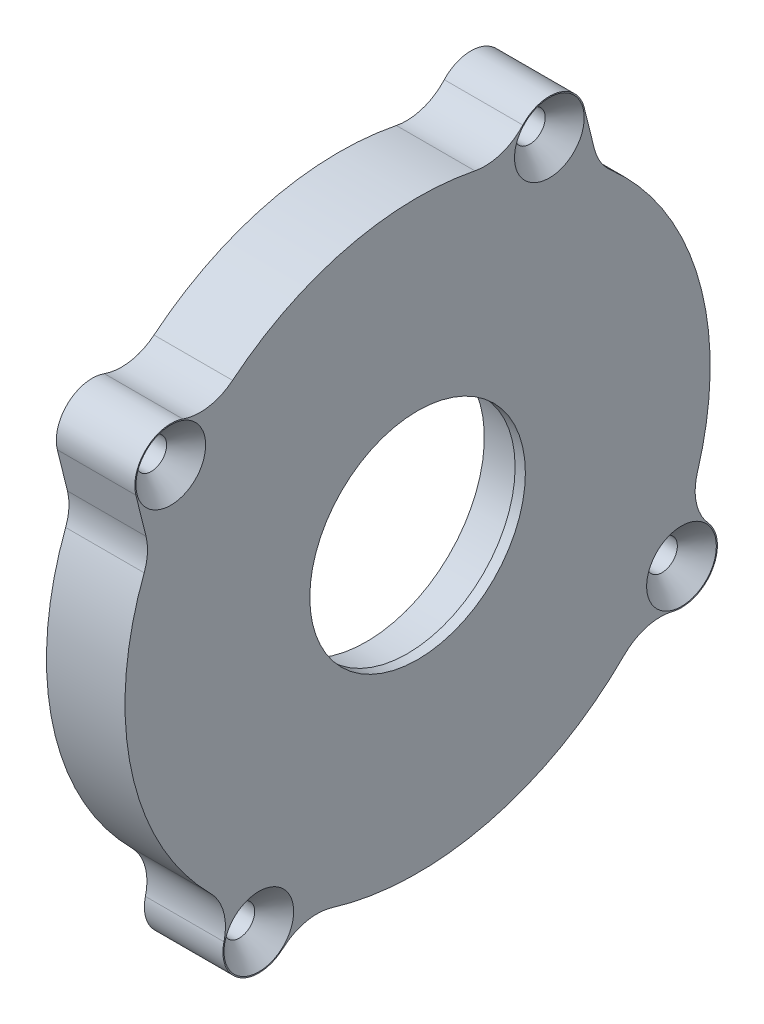
ISO-10303-21;
HEADER;
FILE_DESCRIPTION(('STEP AP214'),'2;1');
FILE_NAME('part.step','',(''),(''),'','','');
FILE_SCHEMA(('AUTOMOTIVE_DESIGN { 1 0 10303 214 1 1 1 1 }'));
ENDSEC;
DATA;
#1=APPLICATION_CONTEXT('core data for automotive mechanical design processes');
#2=APPLICATION_PROTOCOL_DEFINITION('international standard','automotive_design',2000,#1);
#3=PRODUCT_CONTEXT('',#1,'mechanical');
#4=PRODUCT('Part','Part','',(#3));
#5=PRODUCT_RELATED_PRODUCT_CATEGORY('part','',(#4));
#6=PRODUCT_DEFINITION_FORMATION('','',#4);
#7=PRODUCT_DEFINITION_CONTEXT('part definition',#1,'design');
#8=PRODUCT_DEFINITION('design','',#6,#7);
#9=PRODUCT_DEFINITION_SHAPE('','',#8);
#10=(LENGTH_UNIT() NAMED_UNIT(*) SI_UNIT(.MILLI.,.METRE.));
#11=(NAMED_UNIT(*) PLANE_ANGLE_UNIT() SI_UNIT($,.RADIAN.));
#12=(NAMED_UNIT(*) SI_UNIT($,.STERADIAN.) SOLID_ANGLE_UNIT());
#13=UNCERTAINTY_MEASURE_WITH_UNIT(LENGTH_MEASURE(1.E-05),#10,'distance_accuracy_value','');
#14=(GEOMETRIC_REPRESENTATION_CONTEXT(3) GLOBAL_UNCERTAINTY_ASSIGNED_CONTEXT((#13)) GLOBAL_UNIT_ASSIGNED_CONTEXT((#10,
#11,#12)) REPRESENTATION_CONTEXT('',''));
#15=CARTESIAN_POINT('',(0.,0.,0.));
#16=DIRECTION('',(0.,0.,1.));
#17=DIRECTION('',(1.,0.,0.));
#18=AXIS2_PLACEMENT_3D('',#15,#16,#17);
#19=CARTESIAN_POINT('',(0.,0.,0.));
#20=DIRECTION('',(-1.,0.,0.));
#21=DIRECTION('',(0.,0.,1.));
#22=AXIS2_PLACEMENT_3D('',#19,#20,#21);
#23=CYLINDRICAL_SURFACE('',#22,28.5);
#24=CARTESIAN_POINT('',(1.33359374999999,0.,0.));
#25=DIRECTION('',(-1.,0.,0.));
#26=DIRECTION('',(0.,0.,1.));
#27=AXIS2_PLACEMENT_3D('',#24,#25,#26);
#28=CIRCLE('',#27,28.5);
#29=CARTESIAN_POINT('',(1.33359374999999,-20.129496871515,20.175563330417));
#30=VERTEX_POINT('',#29);
#31=CARTESIAN_POINT('',(1.33359374999999,10.1467222164064,26.6325745706848));
#32=VERTEX_POINT('',#31);
#33=EDGE_CURVE('E234',#30,#32,#28,.T.);
#34=ORIENTED_EDGE('',*,*,#33,.T.);
#35=DIRECTION('',(-1.,0.,0.));
#36=VECTOR('',#35,1.);
#37=CARTESIAN_POINT('',(0.,10.1467222164064,26.6325745706848));
#38=LINE('',#37,#36);
#39=CARTESIAN_POINT('',(-6.31640625,10.1467222164064,26.6325745706848));
#40=VERTEX_POINT('',#39);
#41=EDGE_CURVE('E341',#32,#40,#38,.T.);
#42=ORIENTED_EDGE('',*,*,#41,.T.);
#43=CARTESIAN_POINT('',(-6.31640625,0.,0.));
#44=DIRECTION('',(-1.,0.,0.));
#45=DIRECTION('',(0.,0.,1.));
#46=AXIS2_PLACEMENT_3D('',#43,#44,#45);
#47=CIRCLE('',#46,28.5);
#48=CARTESIAN_POINT('',(-6.31640625,-20.129496871515,20.175563330417));
#49=VERTEX_POINT('',#48);
#50=EDGE_CURVE('E229',#49,#40,#47,.T.);
#51=ORIENTED_EDGE('',*,*,#50,.F.);
#52=DIRECTION('',(-1.,0.,0.));
#53=VECTOR('',#52,1.);
#54=CARTESIAN_POINT('',(0.,-20.129496871515,20.175563330417));
#55=LINE('',#54,#53);
#56=EDGE_CURVE('E291',#49,#30,#55,.F.);
#57=ORIENTED_EDGE('',*,*,#56,.T.);
#58=EDGE_LOOP('',(#34,#42,#51,#57));
#59=FACE_BOUND('',#58,.T.);
#60=ADVANCED_FACE('F35',(#59),#23,.T.);
#61=CARTESIAN_POINT('',(10.9805548256899,17.9431748521794,24.0425139331168));
#62=DIRECTION('',(-1.,0.,0.));
#63=DIRECTION('',(0.,0.,1.));
#64=AXIS2_PLACEMENT_3D('',#61,#62,#63);
#65=CYLINDRICAL_SURFACE('',#64,3.5);
#66=CARTESIAN_POINT('',(-6.31640625,17.9431748521794,24.0425139331168));
#67=DIRECTION('',(-1.,0.,0.));
#68=DIRECTION('',(0.,0.,1.));
#69=AXIS2_PLACEMENT_3D('',#66,#67,#68);
#70=CIRCLE('',#69,3.5);
#71=CARTESIAN_POINT('',(-6.31640625,17.0982761668576,27.4390042115574));
#72=VERTEX_POINT('',#71);
#73=CARTESIAN_POINT('',(-6.31640625,21.2397664319237,22.8667231539563));
#74=VERTEX_POINT('',#73);
#75=EDGE_CURVE('E172',#72,#74,#70,.T.);
#76=ORIENTED_EDGE('',*,*,#75,.F.);
#77=DIRECTION('',(-1.,0.,0.));
#78=VECTOR('',#77,1.);
#79=CARTESIAN_POINT('',(7.59537148955582,17.0982761668576,27.4390042115574));
#80=LINE('',#79,#78);
#81=CARTESIAN_POINT('',(1.33359374999999,17.0982761668576,27.4390042115574));
#82=VERTEX_POINT('',#81);
#83=EDGE_CURVE('E175',#82,#72,#80,.T.);
#84=ORIENTED_EDGE('',*,*,#83,.F.);
#85=CARTESIAN_POINT('',(1.33359374999999,17.9431748521794,24.0425139331168));
#86=DIRECTION('',(1.,0.,0.));
#87=DIRECTION('',(0.,0.,-1.));
#88=AXIS2_PLACEMENT_3D('',#85,#86,#87);
#89=CIRCLE('',#88,3.5);
#90=CARTESIAN_POINT('',(1.33359374999999,21.2397664319237,22.8667231539563));
#91=VERTEX_POINT('',#90);
#92=EDGE_CURVE('E158',#82,#91,#89,.F.);
#93=ORIENTED_EDGE('',*,*,#92,.T.);
#94=DIRECTION('',(-1.,0.,0.));
#95=VECTOR('',#94,1.);
#96=CARTESIAN_POINT('',(10.9805548256899,21.2397664319237,22.8667231539563));
#97=LINE('',#96,#95);
#98=EDGE_CURVE('E271',#91,#74,#97,.T.);
#99=ORIENTED_EDGE('',*,*,#98,.T.);
#100=EDGE_LOOP('',(#76,#84,#93,#99));
#101=FACE_BOUND('',#100,.T.);
#102=ADVANCED_FACE('F176',(#101),#65,.T.);
#103=CARTESIAN_POINT('',(-6.31640625,-20.1755633304171,-20.1294968715149));
#104=VERTEX_POINT('',#103);
#105=CARTESIAN_POINT('',(-6.31640625,-27.2552395754631,8.33078121691536));
#106=VERTEX_POINT('',#105);
#107=EDGE_CURVE('E228',#104,#106,#47,.T.);
#108=ORIENTED_EDGE('',*,*,#107,.F.);
#109=DIRECTION('',(-1.,0.,0.));
#110=VECTOR('',#109,1.);
#111=CARTESIAN_POINT('',(0.,-20.1755633304171,-20.1294968715149));
#112=LINE('',#111,#110);
#113=CARTESIAN_POINT('',(1.33359374999999,-20.1755633304171,-20.1294968715149));
#114=VERTEX_POINT('',#113);
#115=EDGE_CURVE('E284',#104,#114,#112,.F.);
#116=ORIENTED_EDGE('',*,*,#115,.T.);
#117=CARTESIAN_POINT('',(1.33359374999999,-27.2552395754631,8.33078121691536));
#118=VERTEX_POINT('',#117);
#119=EDGE_CURVE('E233',#114,#118,#28,.T.);
#120=ORIENTED_EDGE('',*,*,#119,.T.);
#121=DIRECTION('',(-1.,0.,0.));
#122=VECTOR('',#121,1.);
#123=CARTESIAN_POINT('',(0.,-27.2552395754631,8.33078121691536));
#124=LINE('',#123,#122);
#125=EDGE_CURVE('E281',#118,#106,#124,.T.);
#126=ORIENTED_EDGE('',*,*,#125,.T.);
#127=EDGE_LOOP('',(#108,#116,#120,#126));
#128=FACE_BOUND('',#127,.T.);
#129=ADVANCED_FACE('F392',(#128),#23,.T.);
#130=CARTESIAN_POINT('',(1.33359374999999,22.0761705901744,18.0247799452176));
#131=VERTEX_POINT('',#130);
#132=CARTESIAN_POINT('',(1.33359374999999,27.9482319505179,-5.58088978927667));
#133=VERTEX_POINT('',#132);
#134=EDGE_CURVE('E227',#131,#133,#28,.T.);
#135=ORIENTED_EDGE('',*,*,#134,.T.);
#136=DIRECTION('',(-1.,0.,0.));
#137=VECTOR('',#136,1.);
#138=CARTESIAN_POINT('',(0.,27.9482319505179,-5.58088978927667));
#139=LINE('',#138,#137);
#140=CARTESIAN_POINT('',(-6.31640625,27.9482319505179,-5.58088978927667));
#141=VERTEX_POINT('',#140);
#142=EDGE_CURVE('E266',#133,#141,#139,.T.);
#143=ORIENTED_EDGE('',*,*,#142,.T.);
#144=CARTESIAN_POINT('',(-6.31640625,22.0761705901744,18.0247799452176));
#145=VERTEX_POINT('',#144);
#146=EDGE_CURVE('E224',#145,#141,#47,.T.);
#147=ORIENTED_EDGE('',*,*,#146,.F.);
#148=DIRECTION('',(-1.,0.,0.));
#149=VECTOR('',#148,1.);
#150=CARTESIAN_POINT('',(0.,22.0761705901744,18.0247799452176));
#151=LINE('',#150,#149);
#152=EDGE_CURVE('E264',#145,#131,#151,.F.);
#153=ORIENTED_EDGE('',*,*,#152,.T.);
#154=EDGE_LOOP('',(#135,#143,#147,#153));
#155=FACE_BOUND('',#154,.T.);
#156=ADVANCED_FACE('F372',(#155),#23,.T.);
#157=CARTESIAN_POINT('',(-6.31640625,0.,0.));
#158=DIRECTION('',(-1.,0.,0.));
#159=DIRECTION('',(0.,0.,1.));
#160=AXIS2_PLACEMENT_3D('',#157,#158,#159);
#161=PLANE('',#160);
#162=DIRECTION('',(0.,-0.970425793840176,-0.241399624377638));
#163=VECTOR('',#162,1.);
#164=CARTESIAN_POINT('',(-6.31640625,5.43149154849686,-21.834580361404));
#165=LINE('',#164,#163);
#166=CARTESIAN_POINT('',(-6.31640625,27.9612592638514,-16.2301565112504));
#167=VERTEX_POINT('',#166);
#168=CARTESIAN_POINT('',(-6.31640625,23.996830139921,-17.2163336176951));
#169=VERTEX_POINT('',#168);
#170=EDGE_CURVE('E185',#167,#169,#165,.T.);
#171=ORIENTED_EDGE('',*,*,#170,.T.);
#172=CARTESIAN_POINT('',(-6.31640625,25.2038282618092,-22.068462586896));
#173=DIRECTION('',(-1.,0.,0.));
#174=DIRECTION('',(0.,0.,1.));
#175=AXIS2_PLACEMENT_3D('',#172,#173,#174);
#176=CIRCLE('',#175,5.);
#177=CARTESIAN_POINT('',(-6.31640625,21.4420628495989,-18.7746622007921));
#178=VERTEX_POINT('',#177);
#179=EDGE_CURVE('E43',#169,#178,#176,.F.);
#180=ORIENTED_EDGE('',*,*,#179,.T.);
#181=CARTESIAN_POINT('',(-6.31640625,-8.33078121691548,-27.2552395754631));
#182=VERTEX_POINT('',#181);
#183=EDGE_CURVE('E225',#178,#182,#47,.T.);
#184=ORIENTED_EDGE('',*,*,#183,.T.);
#185=CARTESIAN_POINT('',(-6.31640625,-9.79232178128662,-32.0368605536145));
#186=DIRECTION('',(-1.,0.,0.));
#187=DIRECTION('',(0.,0.,1.));
#188=AXIS2_PLACEMENT_3D('',#185,#186,#187);
#189=CIRCLE('',#188,5.);
#190=CARTESIAN_POINT('',(-6.31640625,-13.1291798174018,-28.313236183889));
#191=VERTEX_POINT('',#190);
#192=EDGE_CURVE('E300',#182,#191,#189,.F.);
#193=ORIENTED_EDGE('',*,*,#192,.T.);
#194=CARTESIAN_POINT('',(-6.31640625,-15.4649804426825,-25.7066991250812));
#195=DIRECTION('',(-1.,0.,0.));
#196=DIRECTION('',(0.,0.,1.));
#197=AXIS2_PLACEMENT_3D('',#194,#195,#196);
#198=CIRCLE('',#197,3.5);
#199=CARTESIAN_POINT('',(-6.31640625,-18.862103255206,-24.8643473003475));
#200=VERTEX_POINT('',#199);
#201=EDGE_CURVE('E207',#191,#200,#198,.T.);
#202=ORIENTED_EDGE('',*,*,#201,.T.);
#203=CARTESIAN_POINT('',(-6.31640625,-23.7151358445254,-23.6609875507281));
#204=DIRECTION('',(-1.,0.,0.));
#205=DIRECTION('',(0.,0.,1.));
#206=AXIS2_PLACEMENT_3D('',#203,#204,#205);
#207=CIRCLE('',#206,5.);
#208=EDGE_CURVE('E305',#200,#104,#207,.F.);
#209=ORIENTED_EDGE('',*,*,#208,.T.);
#210=ORIENTED_EDGE('',*,*,#107,.T.);
#211=CARTESIAN_POINT('',(-6.31640625,-32.0368605536145,9.79232178128648));
#212=DIRECTION('',(-1.,0.,0.));
#213=DIRECTION('',(0.,0.,1.));
#214=AXIS2_PLACEMENT_3D('',#211,#212,#213);
#215=CIRCLE('',#214,5.);
#216=CARTESIAN_POINT('',(-6.31640625,-28.3132361838891,13.1291798174017));
#217=VERTEX_POINT('',#216);
#218=EDGE_CURVE('E309',#106,#217,#215,.F.);
#219=ORIENTED_EDGE('',*,*,#218,.T.);
#220=CARTESIAN_POINT('',(-6.31640625,-25.7066991250813,15.4649804426823));
#221=DIRECTION('',(-1.,0.,0.));
#222=DIRECTION('',(0.,0.,1.));
#223=AXIS2_PLACEMENT_3D('',#220,#221,#222);
#224=CIRCLE('',#223,3.5);
#225=CARTESIAN_POINT('',(-6.31640625,-24.8643473003476,18.8621032552059));
#226=VERTEX_POINT('',#225);
#227=EDGE_CURVE('E198',#217,#226,#224,.T.);
#228=ORIENTED_EDGE('',*,*,#227,.T.);
#229=CARTESIAN_POINT('',(-6.31640625,-23.6609875507282,23.7151358445253));
#230=DIRECTION('',(-1.,0.,0.));
#231=DIRECTION('',(0.,0.,1.));
#232=AXIS2_PLACEMENT_3D('',#229,#230,#231);
#233=CIRCLE('',#232,5.);
#234=EDGE_CURVE('E313',#226,#49,#233,.F.);
#235=ORIENTED_EDGE('',*,*,#234,.T.);
#236=ORIENTED_EDGE('',*,*,#50,.T.);
#237=CARTESIAN_POINT('',(-6.31640625,11.9268489210391,31.3049560743137));
#238=DIRECTION('',(-1.,0.,0.));
#239=DIRECTION('',(0.,0.,1.));
#240=AXIS2_PLACEMENT_3D('',#237,#238,#239);
#241=CIRCLE('',#240,5.);
#242=CARTESIAN_POINT('',(-6.31640625,13.1338470429273,26.4528271051128));
#243=VERTEX_POINT('',#242);
#244=EDGE_CURVE('E349',#40,#243,#241,.F.);
#245=ORIENTED_EDGE('',*,*,#244,.T.);
#246=DIRECTION('',(0.,-0.970425793840176,-0.241399624377639));
#247=VECTOR('',#246,1.);
#248=CARTESIAN_POINT('',(-6.31640625,-5.43149154849687,21.8345803614039));
#249=LINE('',#248,#247);
#250=EDGE_CURVE('E180',#72,#243,#249,.T.);
#251=ORIENTED_EDGE('',*,*,#250,.F.);
#252=ORIENTED_EDGE('',*,*,#75,.T.);
#253=CARTESIAN_POINT('',(-6.31640625,25.9491829744155,21.1870220408698));
#254=DIRECTION('',(-1.,0.,0.));
#255=DIRECTION('',(0.,0.,1.));
#256=AXIS2_PLACEMENT_3D('',#253,#254,#255);
#257=CIRCLE('',#256,5.);
#258=EDGE_CURVE('E297',#74,#145,#257,.F.);
#259=ORIENTED_EDGE('',*,*,#258,.T.);
#260=ORIENTED_EDGE('',*,*,#146,.T.);
#261=CARTESIAN_POINT('',(-6.31640625,32.851430538328,-6.55999326107959));
#262=DIRECTION('',(-1.,0.,0.));
#263=DIRECTION('',(0.,0.,1.));
#264=AXIS2_PLACEMENT_3D('',#261,#262,#263);
#265=CIRCLE('',#264,5.);
#266=CARTESIAN_POINT('',(-6.31640625,29.4778599737407,-10.2503891268033));
#267=VERTEX_POINT('',#266);
#268=EDGE_CURVE('E293',#141,#267,#265,.F.);
#269=ORIENTED_EDGE('',*,*,#268,.T.);
#270=CARTESIAN_POINT('',(-6.31640625,27.1163605785296,-12.8336662328098));
#271=DIRECTION('',(-1.,0.,0.));
#272=DIRECTION('',(0.,0.,1.));
#273=AXIS2_PLACEMENT_3D('',#270,#271,#272);
#274=CIRCLE('',#273,3.50000000000001);
#275=EDGE_CURVE('E219',#267,#167,#274,.T.);
#276=ORIENTED_EDGE('',*,*,#275,.T.);
#277=EDGE_LOOP('',(#171,#180,#184,#193,#202,#209,#210,#219,#228,#235,#236,#245,#251,#252,#259,
#260,#269,#276));
#278=FACE_BOUND('',#277,.T.);
#279=CARTESIAN_POINT('',(-6.31640625,0.,0.));
#280=DIRECTION('',(-1.,0.,0.));
#281=DIRECTION('',(0.,0.,1.));
#282=AXIS2_PLACEMENT_3D('',#279,#280,#281);
#283=CIRCLE('',#282,27.5);
#284=CARTESIAN_POINT('',(-6.31640625,0.,27.5));
#285=VERTEX_POINT('',#284);
#286=EDGE_CURVE('E261',#285,#285,#283,.T.);
#287=ORIENTED_EDGE('',*,*,#286,.F.);
#288=EDGE_LOOP('',(#287));
#289=FACE_BOUND('',#288,.T.);
#290=CARTESIAN_POINT('',(-6.31640625,27.1163605785296,-12.8336662328098));
#291=DIRECTION('',(-1.,0.,0.));
#292=DIRECTION('',(0.,0.,1.));
#293=AXIS2_PLACEMENT_3D('',#290,#291,#292);
#294=CIRCLE('',#293,1.495);
#295=CARTESIAN_POINT('',(-6.31640625,27.1163605785296,-11.3386662328098));
#296=VERTEX_POINT('',#295);
#297=EDGE_CURVE('E171',#296,#296,#294,.T.);
#298=ORIENTED_EDGE('',*,*,#297,.F.);
#299=EDGE_LOOP('',(#298));
#300=FACE_BOUND('',#299,.T.);
#301=CARTESIAN_POINT('',(-6.31640625,17.9431748521794,24.0425139331168));
#302=DIRECTION('',(-1.,0.,0.));
#303=DIRECTION('',(0.,0.,1.));
#304=AXIS2_PLACEMENT_3D('',#301,#302,#303);
#305=CIRCLE('',#304,1.495);
#306=CARTESIAN_POINT('',(-6.31640625,17.9431748521794,25.5375139331168));
#307=VERTEX_POINT('',#306);
#308=EDGE_CURVE('E213',#307,#307,#305,.T.);
#309=ORIENTED_EDGE('',*,*,#308,.F.);
#310=EDGE_LOOP('',(#309));
#311=FACE_BOUND('',#310,.T.);
#312=CARTESIAN_POINT('',(-6.31640625,-15.4649804426825,-25.7066991250812));
#313=DIRECTION('',(-1.,0.,0.));
#314=DIRECTION('',(0.,0.,1.));
#315=AXIS2_PLACEMENT_3D('',#312,#313,#314);
#316=CIRCLE('',#315,1.495);
#317=CARTESIAN_POINT('',(-6.31640625,-15.4649804426825,-24.2116991250812));
#318=VERTEX_POINT('',#317);
#319=EDGE_CURVE('E204',#318,#318,#316,.T.);
#320=ORIENTED_EDGE('',*,*,#319,.F.);
#321=EDGE_LOOP('',(#320));
#322=FACE_BOUND('',#321,.T.);
#323=CARTESIAN_POINT('',(-6.31640625,-25.7066991250813,15.4649804426823));
#324=DIRECTION('',(-1.,0.,0.));
#325=DIRECTION('',(0.,0.,1.));
#326=AXIS2_PLACEMENT_3D('',#323,#324,#325);
#327=CIRCLE('',#326,1.495);
#328=CARTESIAN_POINT('',(-6.31640625,-25.7066991250813,16.9599804426823));
#329=VERTEX_POINT('',#328);
#330=EDGE_CURVE('E195',#329,#329,#327,.T.);
#331=ORIENTED_EDGE('',*,*,#330,.F.);
#332=EDGE_LOOP('',(#331));
#333=FACE_BOUND('',#332,.T.);
#334=ADVANCED_FACE('F362',(#278,#289,#300,#311,#322,#333),#161,.T.);
#335=CARTESIAN_POINT('',(0.,0.,0.));
#336=DIRECTION('',(-1.,0.,0.));
#337=DIRECTION('',(0.,0.,1.));
#338=AXIS2_PLACEMENT_3D('',#335,#336,#337);
#339=CYLINDRICAL_SURFACE('',#338,27.5);
#340=ORIENTED_EDGE('',*,*,#286,.T.);
#341=EDGE_LOOP('',(#340));
#342=FACE_BOUND('',#341,.T.);
#343=CARTESIAN_POINT('',(-6.81640625,0.,0.));
#344=DIRECTION('',(-1.,0.,0.));
#345=DIRECTION('',(0.,0.,1.));
#346=AXIS2_PLACEMENT_3D('',#343,#344,#345);
#347=CIRCLE('',#346,27.5);
#348=CARTESIAN_POINT('',(-6.81640625,0.,27.5));
#349=VERTEX_POINT('',#348);
#350=EDGE_CURVE('E258',#349,#349,#347,.T.);
#351=ORIENTED_EDGE('',*,*,#350,.F.);
#352=EDGE_LOOP('',(#351));
#353=FACE_BOUND('',#352,.T.);
#354=ADVANCED_FACE('F415',(#342,#353),#339,.T.);
#355=CARTESIAN_POINT('',(-6.81640625,0.,0.));
#356=DIRECTION('',(-1.,0.,0.));
#357=DIRECTION('',(0.,0.,1.));
#358=AXIS2_PLACEMENT_3D('',#355,#356,#357);
#359=PLANE('',#358);
#360=ORIENTED_EDGE('',*,*,#350,.T.);
#361=EDGE_LOOP('',(#360));
#362=FACE_BOUND('',#361,.T.);
#363=CARTESIAN_POINT('',(-6.81640625,0.,0.));
#364=DIRECTION('',(-1.,0.,0.));
#365=DIRECTION('',(0.,0.,1.));
#366=AXIS2_PLACEMENT_3D('',#363,#364,#365);
#367=CIRCLE('',#366,26.5);
#368=CARTESIAN_POINT('',(-6.81640625,0.,26.5));
#369=VERTEX_POINT('',#368);
#370=EDGE_CURVE('E255',#369,#369,#367,.T.);
#371=ORIENTED_EDGE('',*,*,#370,.F.);
#372=EDGE_LOOP('',(#371));
#373=FACE_BOUND('',#372,.T.);
#374=ADVANCED_FACE('F420',(#362,#373),#359,.T.);
#375=CARTESIAN_POINT('',(0.,0.,0.));
#376=DIRECTION('',(-1.,0.,0.));
#377=DIRECTION('',(0.,0.,1.));
#378=AXIS2_PLACEMENT_3D('',#375,#376,#377);
#379=CYLINDRICAL_SURFACE('',#378,26.5);
#380=ORIENTED_EDGE('',*,*,#370,.T.);
#381=EDGE_LOOP('',(#380));
#382=FACE_BOUND('',#381,.T.);
#383=CARTESIAN_POINT('',(-0.666406250000008,0.,0.));
#384=DIRECTION('',(-1.,0.,0.));
#385=DIRECTION('',(0.,0.,1.));
#386=AXIS2_PLACEMENT_3D('',#383,#384,#385);
#387=CIRCLE('',#386,26.5);
#388=CARTESIAN_POINT('',(-0.666406250000008,0.,26.5));
#389=VERTEX_POINT('',#388);
#390=EDGE_CURVE('E252',#389,#389,#387,.T.);
#391=ORIENTED_EDGE('',*,*,#390,.F.);
#392=EDGE_LOOP('',(#391));
#393=FACE_BOUND('',#392,.T.);
#394=ADVANCED_FACE('F426',(#382,#393),#379,.F.);
#395=CARTESIAN_POINT('',(-0.666406250000008,0.,0.));
#396=DIRECTION('',(-1.,0.,0.));
#397=DIRECTION('',(0.,0.,1.));
#398=AXIS2_PLACEMENT_3D('',#395,#396,#397);
#399=PLANE('',#398);
#400=ORIENTED_EDGE('',*,*,#390,.T.);
#401=EDGE_LOOP('',(#400));
#402=FACE_BOUND('',#401,.T.);
#403=CARTESIAN_POINT('',(-0.666406250000008,0.,0.));
#404=DIRECTION('',(-1.,0.,0.));
#405=DIRECTION('',(0.,0.,1.));
#406=AXIS2_PLACEMENT_3D('',#403,#404,#405);
#407=CIRCLE('',#406,13.);
#408=CARTESIAN_POINT('',(-0.666406250000008,0.,13.));
#409=VERTEX_POINT('',#408);
#410=EDGE_CURVE('E249',#409,#409,#407,.T.);
#411=ORIENTED_EDGE('',*,*,#410,.F.);
#412=EDGE_LOOP('',(#411));
#413=FACE_BOUND('',#412,.T.);
#414=ADVANCED_FACE('F430',(#402,#413),#399,.T.);
#415=CARTESIAN_POINT('',(0.,0.,0.));
#416=DIRECTION('',(-1.,0.,0.));
#417=DIRECTION('',(0.,0.,1.));
#418=AXIS2_PLACEMENT_3D('',#415,#416,#417);
#419=CYLINDRICAL_SURFACE('',#418,13.);
#420=ORIENTED_EDGE('',*,*,#410,.T.);
#421=EDGE_LOOP('',(#420));
#422=FACE_BOUND('',#421,.T.);
#423=CARTESIAN_POINT('',(-3.66640625,0.,0.));
#424=DIRECTION('',(-1.,0.,0.));
#425=DIRECTION('',(0.,0.,1.));
#426=AXIS2_PLACEMENT_3D('',#423,#424,#425);
#427=CIRCLE('',#426,13.);
#428=CARTESIAN_POINT('',(-3.66640625,0.,13.));
#429=VERTEX_POINT('',#428);
#430=EDGE_CURVE('E246',#429,#429,#427,.T.);
#431=ORIENTED_EDGE('',*,*,#430,.F.);
#432=EDGE_LOOP('',(#431));
#433=FACE_BOUND('',#432,.T.);
#434=ADVANCED_FACE('F434',(#422,#433),#419,.T.);
#435=CARTESIAN_POINT('',(-3.66640625,0.,0.));
#436=DIRECTION('',(-1.,0.,0.));
#437=DIRECTION('',(0.,0.,1.));
#438=AXIS2_PLACEMENT_3D('',#435,#436,#437);
#439=PLANE('',#438);
#440=ORIENTED_EDGE('',*,*,#430,.T.);
#441=EDGE_LOOP('',(#440));
#442=FACE_BOUND('',#441,.T.);
#443=CARTESIAN_POINT('',(-3.66640625,0.,0.));
#444=DIRECTION('',(-1.,0.,0.));
#445=DIRECTION('',(0.,0.,1.));
#446=AXIS2_PLACEMENT_3D('',#443,#444,#445);
#447=CIRCLE('',#446,11.5);
#448=CARTESIAN_POINT('',(-3.66640625,0.,11.5));
#449=VERTEX_POINT('',#448);
#450=EDGE_CURVE('E243',#449,#449,#447,.T.);
#451=ORIENTED_EDGE('',*,*,#450,.F.);
#452=EDGE_LOOP('',(#451));
#453=FACE_BOUND('',#452,.T.);
#454=ADVANCED_FACE('F438',(#442,#453),#439,.T.);
#455=CARTESIAN_POINT('',(0.,0.,0.));
#456=DIRECTION('',(-1.,0.,0.));
#457=DIRECTION('',(0.,0.,1.));
#458=AXIS2_PLACEMENT_3D('',#455,#456,#457);
#459=CYLINDRICAL_SURFACE('',#458,11.5);
#460=ORIENTED_EDGE('',*,*,#450,.T.);
#461=EDGE_LOOP('',(#460));
#462=FACE_BOUND('',#461,.T.);
#463=CARTESIAN_POINT('',(0.333593749999997,0.,0.));
#464=DIRECTION('',(-1.,0.,0.));
#465=DIRECTION('',(0.,0.,1.));
#466=AXIS2_PLACEMENT_3D('',#463,#464,#465);
#467=CIRCLE('',#466,11.5);
#468=CARTESIAN_POINT('',(0.333593749999997,0.,11.5));
#469=VERTEX_POINT('',#468);
#470=EDGE_CURVE('E240',#469,#469,#467,.T.);
#471=ORIENTED_EDGE('',*,*,#470,.F.);
#472=EDGE_LOOP('',(#471));
#473=FACE_BOUND('',#472,.T.);
#474=ADVANCED_FACE('F442',(#462,#473),#459,.F.);
#475=CARTESIAN_POINT('',(0.333593749999997,0.,0.));
#476=DIRECTION('',(-1.,0.,0.));
#477=DIRECTION('',(0.,0.,1.));
#478=AXIS2_PLACEMENT_3D('',#475,#476,#477);
#479=PLANE('',#478);
#480=ORIENTED_EDGE('',*,*,#470,.T.);
#481=EDGE_LOOP('',(#480));
#482=FACE_BOUND('',#481,.T.);
#483=CARTESIAN_POINT('',(0.333593749999997,0.,0.));
#484=DIRECTION('',(-1.,0.,0.));
#485=DIRECTION('',(0.,0.,1.));
#486=AXIS2_PLACEMENT_3D('',#483,#484,#485);
#487=CIRCLE('',#486,10.5);
#488=CARTESIAN_POINT('',(0.333593749999997,0.,10.5));
#489=VERTEX_POINT('',#488);
#490=EDGE_CURVE('E237',#489,#489,#487,.T.);
#491=ORIENTED_EDGE('',*,*,#490,.F.);
#492=EDGE_LOOP('',(#491));
#493=FACE_BOUND('',#492,.T.);
#494=ADVANCED_FACE('F446',(#482,#493),#479,.T.);
#495=CARTESIAN_POINT('',(0.,0.,0.));
#496=DIRECTION('',(-1.,0.,0.));
#497=DIRECTION('',(0.,0.,1.));
#498=AXIS2_PLACEMENT_3D('',#495,#496,#497);
#499=CYLINDRICAL_SURFACE('',#498,10.5);
#500=ORIENTED_EDGE('',*,*,#490,.T.);
#501=EDGE_LOOP('',(#500));
#502=FACE_BOUND('',#501,.T.);
#503=CARTESIAN_POINT('',(1.33359375,0.,0.));
#504=DIRECTION('',(-1.,0.,0.));
#505=DIRECTION('',(0.,0.,1.));
#506=AXIS2_PLACEMENT_3D('',#503,#504,#505);
#507=CIRCLE('',#506,10.5);
#508=CARTESIAN_POINT('',(1.33359375,0.,10.5));
#509=VERTEX_POINT('',#508);
#510=EDGE_CURVE('E232',#509,#509,#507,.T.);
#511=ORIENTED_EDGE('',*,*,#510,.F.);
#512=EDGE_LOOP('',(#511));
#513=FACE_BOUND('',#512,.T.);
#514=ADVANCED_FACE('F410',(#502,#513),#499,.F.);
#515=CARTESIAN_POINT('',(1.33359374999999,0.,0.));
#516=DIRECTION('',(1.,0.,0.));
#517=DIRECTION('',(0.,0.,-1.));
#518=AXIS2_PLACEMENT_3D('',#515,#516,#517);
#519=PLANE('',#518);
#520=CARTESIAN_POINT('',(1.33359374999999,21.4420628495989,-18.7746622007921));
#521=VERTEX_POINT('',#520);
#522=CARTESIAN_POINT('',(1.33359374999999,-8.33078121691548,-27.2552395754631));
#523=VERTEX_POINT('',#522);
#524=EDGE_CURVE('E230',#521,#523,#28,.T.);
#525=ORIENTED_EDGE('',*,*,#524,.F.);
#526=CARTESIAN_POINT('',(1.33359374999999,25.2038282618092,-22.068462586896));
#527=DIRECTION('',(1.,0.,0.));
#528=DIRECTION('',(0.,0.,-1.));
#529=AXIS2_PLACEMENT_3D('',#526,#527,#528);
#530=CIRCLE('',#529,5.);
#531=CARTESIAN_POINT('',(1.33359374999999,23.996830139921,-17.2163336176951));
#532=VERTEX_POINT('',#531);
#533=EDGE_CURVE('E11',#521,#532,#530,.F.);
#534=ORIENTED_EDGE('',*,*,#533,.T.);
#535=DIRECTION('',(0.,-0.970425793840176,-0.241399624377638));
#536=VECTOR('',#535,1.);
#537=CARTESIAN_POINT('',(1.33359374999999,5.43149154849686,-21.834580361404));
#538=LINE('',#537,#536);
#539=CARTESIAN_POINT('',(1.33359374999999,27.9612592638514,-16.2301565112504));
#540=VERTEX_POINT('',#539);
#541=EDGE_CURVE('E187',#540,#532,#538,.T.);
#542=ORIENTED_EDGE('',*,*,#541,.F.);
#543=CARTESIAN_POINT('',(1.33359374999999,27.1163605785296,-12.8336662328098));
#544=DIRECTION('',(1.,0.,0.));
#545=DIRECTION('',(0.,0.,-1.));
#546=AXIS2_PLACEMENT_3D('',#543,#544,#545);
#547=CIRCLE('',#546,3.50000000000001);
#548=CARTESIAN_POINT('',(1.33359374999999,29.4778599737407,-10.2503891268033));
#549=VERTEX_POINT('',#548);
#550=EDGE_CURVE('E222',#549,#540,#547,.F.);
#551=ORIENTED_EDGE('',*,*,#550,.F.);
#552=CARTESIAN_POINT('',(1.33359374999999,32.851430538328,-6.55999326107959));
#553=DIRECTION('',(1.,0.,0.));
#554=DIRECTION('',(0.,0.,-1.));
#555=AXIS2_PLACEMENT_3D('',#552,#553,#554);
#556=CIRCLE('',#555,5.);
#557=EDGE_CURVE('E295',#549,#133,#556,.F.);
#558=ORIENTED_EDGE('',*,*,#557,.T.);
#559=ORIENTED_EDGE('',*,*,#134,.F.);
#560=CARTESIAN_POINT('',(1.33359374999999,25.9491829744155,21.1870220408698));
#561=DIRECTION('',(1.,0.,0.));
#562=DIRECTION('',(0.,0.,-1.));
#563=AXIS2_PLACEMENT_3D('',#560,#561,#562);
#564=CIRCLE('',#563,5.);
#565=EDGE_CURVE('E167',#131,#91,#564,.F.);
#566=ORIENTED_EDGE('',*,*,#565,.T.);
#567=ORIENTED_EDGE('',*,*,#92,.F.);
#568=DIRECTION('',(0.,-0.970425793840176,-0.241399624377639));
#569=VECTOR('',#568,1.);
#570=CARTESIAN_POINT('',(1.33359374999999,-5.43149154849687,21.8345803614039));
#571=LINE('',#570,#569);
#572=CARTESIAN_POINT('',(1.33359374999999,13.1338470429273,26.4528271051128));
#573=VERTEX_POINT('',#572);
#574=EDGE_CURVE('E163',#82,#573,#571,.T.);
#575=ORIENTED_EDGE('',*,*,#574,.T.);
#576=CARTESIAN_POINT('',(1.33359374999999,11.9268489210391,31.3049560743137));
#577=DIRECTION('',(1.,0.,0.));
#578=DIRECTION('',(0.,0.,-1.));
#579=AXIS2_PLACEMENT_3D('',#576,#577,#578);
#580=CIRCLE('',#579,5.);
#581=EDGE_CURVE('E351',#573,#32,#580,.F.);
#582=ORIENTED_EDGE('',*,*,#581,.T.);
#583=ORIENTED_EDGE('',*,*,#33,.F.);
#584=CARTESIAN_POINT('',(1.33359374999999,-23.6609875507282,23.7151358445253));
#585=DIRECTION('',(1.,0.,0.));
#586=DIRECTION('',(0.,0.,-1.));
#587=AXIS2_PLACEMENT_3D('',#584,#585,#586);
#588=CIRCLE('',#587,5.);
#589=CARTESIAN_POINT('',(1.33359374999999,-24.8643473003476,18.8621032552059));
#590=VERTEX_POINT('',#589);
#591=EDGE_CURVE('E315',#30,#590,#588,.F.);
#592=ORIENTED_EDGE('',*,*,#591,.T.);
#593=CARTESIAN_POINT('',(1.33359374999999,-25.7066991250813,15.4649804426823));
#594=DIRECTION('',(1.,0.,0.));
#595=DIRECTION('',(0.,0.,-1.));
#596=AXIS2_PLACEMENT_3D('',#593,#594,#595);
#597=CIRCLE('',#596,3.5);
#598=CARTESIAN_POINT('',(1.33359374999999,-28.3132361838891,13.1291798174017));
#599=VERTEX_POINT('',#598);
#600=EDGE_CURVE('E201',#599,#590,#597,.F.);
#601=ORIENTED_EDGE('',*,*,#600,.F.);
#602=CARTESIAN_POINT('',(1.33359374999999,-32.0368605536145,9.79232178128648));
#603=DIRECTION('',(1.,0.,0.));
#604=DIRECTION('',(0.,0.,-1.));
#605=AXIS2_PLACEMENT_3D('',#602,#603,#604);
#606=CIRCLE('',#605,5.);
#607=EDGE_CURVE('E311',#599,#118,#606,.F.);
#608=ORIENTED_EDGE('',*,*,#607,.T.);
#609=ORIENTED_EDGE('',*,*,#119,.F.);
#610=CARTESIAN_POINT('',(1.33359374999999,-23.7151358445254,-23.6609875507281));
#611=DIRECTION('',(1.,0.,0.));
#612=DIRECTION('',(0.,0.,-1.));
#613=AXIS2_PLACEMENT_3D('',#610,#611,#612);
#614=CIRCLE('',#613,5.);
#615=CARTESIAN_POINT('',(1.33359374999999,-18.862103255206,-24.8643473003475));
#616=VERTEX_POINT('',#615);
#617=EDGE_CURVE('E307',#114,#616,#614,.F.);
#618=ORIENTED_EDGE('',*,*,#617,.T.);
#619=CARTESIAN_POINT('',(1.33359374999999,-15.4649804426825,-25.7066991250812));
#620=DIRECTION('',(1.,0.,0.));
#621=DIRECTION('',(0.,0.,-1.));
#622=AXIS2_PLACEMENT_3D('',#619,#620,#621);
#623=CIRCLE('',#622,3.5);
#624=CARTESIAN_POINT('',(1.33359374999999,-13.1291798174018,-28.313236183889));
#625=VERTEX_POINT('',#624);
#626=EDGE_CURVE('E210',#625,#616,#623,.F.);
#627=ORIENTED_EDGE('',*,*,#626,.F.);
#628=CARTESIAN_POINT('',(1.33359374999999,-9.79232178128662,-32.0368605536145));
#629=DIRECTION('',(1.,0.,0.));
#630=DIRECTION('',(0.,0.,-1.));
#631=AXIS2_PLACEMENT_3D('',#628,#629,#630);
#632=CIRCLE('',#631,5.);
#633=EDGE_CURVE('E302',#625,#523,#632,.F.);
#634=ORIENTED_EDGE('',*,*,#633,.T.);
#635=EDGE_LOOP('',(#525,#534,#542,#551,#558,#559,#566,#567,#575,#582,#583,#592,#601,#608,#609,
#618,#627,#634));
#636=FACE_BOUND('',#635,.T.);
#637=CARTESIAN_POINT('',(1.33359374999999,-25.7066991250813,15.4649804426823));
#638=DIRECTION('',(1.,0.,0.));
#639=DIRECTION('',(0.,0.,-1.));
#640=AXIS2_PLACEMENT_3D('',#637,#638,#639);
#641=CIRCLE('',#640,3.395);
#642=CARTESIAN_POINT('',(1.33359374999999,-25.7066991250813,12.0699804426823));
#643=VERTEX_POINT('',#642);
#644=EDGE_CURVE('E326',#643,#643,#641,.F.);
#645=ORIENTED_EDGE('',*,*,#644,.T.);
#646=EDGE_LOOP('',(#645));
#647=FACE_BOUND('',#646,.T.);
#648=CARTESIAN_POINT('',(1.33359374999999,-15.4649804426825,-25.7066991250812));
#649=DIRECTION('',(1.,0.,0.));
#650=DIRECTION('',(0.,0.,-1.));
#651=AXIS2_PLACEMENT_3D('',#648,#649,#650);
#652=CIRCLE('',#651,3.395);
#653=CARTESIAN_POINT('',(1.33359374999999,-15.4649804426825,-29.1016991250812));
#654=VERTEX_POINT('',#653);
#655=EDGE_CURVE('E323',#654,#654,#652,.F.);
#656=ORIENTED_EDGE('',*,*,#655,.T.);
#657=EDGE_LOOP('',(#656));
#658=FACE_BOUND('',#657,.T.);
#659=CARTESIAN_POINT('',(1.33359374999999,27.1163605785296,-12.8336662328098));
#660=DIRECTION('',(1.,0.,0.));
#661=DIRECTION('',(0.,0.,-1.));
#662=AXIS2_PLACEMENT_3D('',#659,#660,#661);
#663=CIRCLE('',#662,3.395);
#664=CARTESIAN_POINT('',(1.33359374999999,27.1163605785296,-16.2286662328098));
#665=VERTEX_POINT('',#664);
#666=EDGE_CURVE('E320',#665,#665,#663,.F.);
#667=ORIENTED_EDGE('',*,*,#666,.T.);
#668=EDGE_LOOP('',(#667));
#669=FACE_BOUND('',#668,.T.);
#670=CARTESIAN_POINT('',(1.33359374999999,17.9431748521794,24.0425139331168));
#671=DIRECTION('',(1.,0.,0.));
#672=DIRECTION('',(0.,0.,-1.));
#673=AXIS2_PLACEMENT_3D('',#670,#671,#672);
#674=CIRCLE('',#673,3.395);
#675=CARTESIAN_POINT('',(1.33359374999999,17.9431748521794,20.6475139331168));
#676=VERTEX_POINT('',#675);
#677=EDGE_CURVE('E317',#676,#676,#674,.F.);
#678=ORIENTED_EDGE('',*,*,#677,.T.);
#679=EDGE_LOOP('',(#678));
#680=FACE_BOUND('',#679,.T.);
#681=ORIENTED_EDGE('',*,*,#510,.T.);
#682=EDGE_LOOP('',(#681));
#683=FACE_BOUND('',#682,.T.);
#684=ADVANCED_FACE('F160',(#636,#647,#658,#669,#680,#683),#519,.T.);
#685=ORIENTED_EDGE('',*,*,#183,.F.);
#686=DIRECTION('',(-1.,0.,0.));
#687=VECTOR('',#686,1.);
#688=CARTESIAN_POINT('',(0.,21.4420628495989,-18.7746622007921));
#689=LINE('',#688,#687);
#690=EDGE_CURVE('E56',#178,#521,#689,.F.);
#691=ORIENTED_EDGE('',*,*,#690,.T.);
#692=ORIENTED_EDGE('',*,*,#524,.T.);
#693=DIRECTION('',(-1.,0.,0.));
#694=VECTOR('',#693,1.);
#695=CARTESIAN_POINT('',(0.,-8.33078121691548,-27.2552395754631));
#696=LINE('',#695,#694);
#697=EDGE_CURVE('E273',#523,#182,#696,.T.);
#698=ORIENTED_EDGE('',*,*,#697,.T.);
#699=EDGE_LOOP('',(#685,#691,#692,#698));
#700=FACE_BOUND('',#699,.T.);
#701=ADVANCED_FACE('F393',(#700),#23,.T.);
#702=CARTESIAN_POINT('',(10.9805548256899,27.1163605785296,-12.8336662328098));
#703=DIRECTION('',(-1.,0.,0.));
#704=DIRECTION('',(0.,0.,1.));
#705=AXIS2_PLACEMENT_3D('',#702,#703,#704);
#706=CYLINDRICAL_SURFACE('',#705,1.495);
#707=CARTESIAN_POINT('',(-0.566406250000017,27.1163605785296,-12.8336662328098));
#708=DIRECTION('',(1.,0.,0.));
#709=DIRECTION('',(0.,0.,-1.));
#710=AXIS2_PLACEMENT_3D('',#707,#708,#709);
#711=CIRCLE('',#710,1.495);
#712=CARTESIAN_POINT('',(-0.566406250000017,27.1163605785296,-14.3286662328098));
#713=VERTEX_POINT('',#712);
#714=EDGE_CURVE('E335',#713,#713,#711,.T.);
#715=ORIENTED_EDGE('',*,*,#714,.T.);
#716=EDGE_LOOP('',(#715));
#717=FACE_BOUND('',#716,.T.);
#718=ORIENTED_EDGE('',*,*,#297,.T.);
#719=EDGE_LOOP('',(#718));
#720=FACE_BOUND('',#719,.T.);
#721=ADVANCED_FACE('F403',(#717,#720),#706,.F.);
#722=CARTESIAN_POINT('',(10.9805548256899,27.1163605785296,-12.8336662328098));
#723=DIRECTION('',(-1.,0.,0.));
#724=DIRECTION('',(0.,0.,1.));
#725=AXIS2_PLACEMENT_3D('',#722,#723,#724);
#726=CYLINDRICAL_SURFACE('',#725,3.50000000000001);
#727=DIRECTION('',(-1.,0.,0.));
#728=VECTOR('',#727,1.);
#729=CARTESIAN_POINT('',(7.59537148955582,27.9612592638514,-16.2301565112504));
#730=LINE('',#729,#728);
#731=EDGE_CURVE('E193',#540,#167,#730,.T.);
#732=ORIENTED_EDGE('',*,*,#731,.T.);
#733=ORIENTED_EDGE('',*,*,#275,.F.);
#734=DIRECTION('',(-1.,0.,0.));
#735=VECTOR('',#734,1.);
#736=CARTESIAN_POINT('',(10.9805548256899,29.4778599737407,-10.2503891268033));
#737=LINE('',#736,#735);
#738=EDGE_CURVE('E269',#267,#549,#737,.F.);
#739=ORIENTED_EDGE('',*,*,#738,.T.);
#740=ORIENTED_EDGE('',*,*,#550,.T.);
#741=EDGE_LOOP('',(#732,#733,#739,#740));
#742=FACE_BOUND('',#741,.T.);
#743=ADVANCED_FACE('F408',(#742),#726,.T.);
#744=CARTESIAN_POINT('',(10.9805548256899,17.9431748521794,24.0425139331168));
#745=DIRECTION('',(-1.,0.,0.));
#746=DIRECTION('',(0.,0.,1.));
#747=AXIS2_PLACEMENT_3D('',#744,#745,#746);
#748=CYLINDRICAL_SURFACE('',#747,1.495);
#749=CARTESIAN_POINT('',(-0.566406250000017,17.9431748521794,24.0425139331168));
#750=DIRECTION('',(1.,0.,0.));
#751=DIRECTION('',(0.,0.,-1.));
#752=AXIS2_PLACEMENT_3D('',#749,#750,#751);
#753=CIRCLE('',#752,1.495);
#754=CARTESIAN_POINT('',(-0.566406250000017,17.9431748521794,22.5475139331168));
#755=VERTEX_POINT('',#754);
#756=EDGE_CURVE('E338',#755,#755,#753,.T.);
#757=ORIENTED_EDGE('',*,*,#756,.T.);
#758=EDGE_LOOP('',(#757));
#759=FACE_BOUND('',#758,.T.);
#760=ORIENTED_EDGE('',*,*,#308,.T.);
#761=EDGE_LOOP('',(#760));
#762=FACE_BOUND('',#761,.T.);
#763=ADVANCED_FACE('F568',(#759,#762),#748,.F.);
#764=CARTESIAN_POINT('',(10.9805548256899,-15.4649804426825,-25.7066991250812));
#765=DIRECTION('',(-1.,0.,0.));
#766=DIRECTION('',(0.,0.,1.));
#767=AXIS2_PLACEMENT_3D('',#764,#765,#766);
#768=CYLINDRICAL_SURFACE('',#767,1.495);
#769=CARTESIAN_POINT('',(-0.566406250000017,-15.4649804426825,-25.7066991250812));
#770=DIRECTION('',(1.,0.,0.));
#771=DIRECTION('',(0.,0.,-1.));
#772=AXIS2_PLACEMENT_3D('',#769,#770,#771);
#773=CIRCLE('',#772,1.495);
#774=CARTESIAN_POINT('',(-0.566406250000017,-15.4649804426825,-27.2016991250812));
#775=VERTEX_POINT('',#774);
#776=EDGE_CURVE('E332',#775,#775,#773,.T.);
#777=ORIENTED_EDGE('',*,*,#776,.T.);
#778=EDGE_LOOP('',(#777));
#779=FACE_BOUND('',#778,.T.);
#780=ORIENTED_EDGE('',*,*,#319,.T.);
#781=EDGE_LOOP('',(#780));
#782=FACE_BOUND('',#781,.T.);
#783=ADVANCED_FACE('F571',(#779,#782),#768,.F.);
#784=CARTESIAN_POINT('',(10.9805548256899,-15.4649804426825,-25.7066991250812));
#785=DIRECTION('',(-1.,0.,0.));
#786=DIRECTION('',(0.,0.,1.));
#787=AXIS2_PLACEMENT_3D('',#784,#785,#786);
#788=CYLINDRICAL_SURFACE('',#787,3.5);
#789=ORIENTED_EDGE('',*,*,#201,.F.);
#790=DIRECTION('',(-1.,0.,0.));
#791=VECTOR('',#790,1.);
#792=CARTESIAN_POINT('',(10.9805548256899,-13.1291798174018,-28.313236183889));
#793=LINE('',#792,#791);
#794=EDGE_CURVE('E279',#191,#625,#793,.F.);
#795=ORIENTED_EDGE('',*,*,#794,.T.);
#796=ORIENTED_EDGE('',*,*,#626,.T.);
#797=DIRECTION('',(-1.,0.,0.));
#798=VECTOR('',#797,1.);
#799=CARTESIAN_POINT('',(10.9805548256899,-18.862103255206,-24.8643473003475));
#800=LINE('',#799,#798);
#801=EDGE_CURVE('E276',#616,#200,#800,.T.);
#802=ORIENTED_EDGE('',*,*,#801,.T.);
#803=EDGE_LOOP('',(#789,#795,#796,#802));
#804=FACE_BOUND('',#803,.T.);
#805=ADVANCED_FACE('F582',(#804),#788,.T.);
#806=CARTESIAN_POINT('',(10.9805548256899,-25.7066991250813,15.4649804426823));
#807=DIRECTION('',(-1.,0.,0.));
#808=DIRECTION('',(0.,0.,1.));
#809=AXIS2_PLACEMENT_3D('',#806,#807,#808);
#810=CYLINDRICAL_SURFACE('',#809,1.495);
#811=CARTESIAN_POINT('',(-0.566406250000017,-25.7066991250813,15.4649804426823));
#812=DIRECTION('',(1.,0.,0.));
#813=DIRECTION('',(0.,0.,-1.));
#814=AXIS2_PLACEMENT_3D('',#811,#812,#813);
#815=CIRCLE('',#814,1.495);
#816=CARTESIAN_POINT('',(-0.566406250000017,-25.7066991250813,13.9699804426824));
#817=VERTEX_POINT('',#816);
#818=EDGE_CURVE('E329',#817,#817,#815,.T.);
#819=ORIENTED_EDGE('',*,*,#818,.T.);
#820=EDGE_LOOP('',(#819));
#821=FACE_BOUND('',#820,.T.);
#822=ORIENTED_EDGE('',*,*,#330,.T.);
#823=EDGE_LOOP('',(#822));
#824=FACE_BOUND('',#823,.T.);
#825=ADVANCED_FACE('F580',(#821,#824),#810,.F.);
#826=CARTESIAN_POINT('',(10.9805548256899,-25.7066991250813,15.4649804426823));
#827=DIRECTION('',(-1.,0.,0.));
#828=DIRECTION('',(0.,0.,1.));
#829=AXIS2_PLACEMENT_3D('',#826,#827,#828);
#830=CYLINDRICAL_SURFACE('',#829,3.5);
#831=ORIENTED_EDGE('',*,*,#227,.F.);
#832=DIRECTION('',(-1.,0.,0.));
#833=VECTOR('',#832,1.);
#834=CARTESIAN_POINT('',(10.9805548256899,-28.3132361838891,13.1291798174017));
#835=LINE('',#834,#833);
#836=EDGE_CURVE('E289',#217,#599,#835,.F.);
#837=ORIENTED_EDGE('',*,*,#836,.T.);
#838=ORIENTED_EDGE('',*,*,#600,.T.);
#839=DIRECTION('',(-1.,0.,0.));
#840=VECTOR('',#839,1.);
#841=CARTESIAN_POINT('',(10.9805548256899,-24.8643473003476,18.8621032552059));
#842=LINE('',#841,#840);
#843=EDGE_CURVE('E286',#590,#226,#842,.T.);
#844=ORIENTED_EDGE('',*,*,#843,.T.);
#845=EDGE_LOOP('',(#831,#837,#838,#844));
#846=FACE_BOUND('',#845,.T.);
#847=ADVANCED_FACE('F387',(#846),#830,.T.);
#848=CARTESIAN_POINT('',(10.9805548256899,32.851430538328,-6.55999326107959));
#849=DIRECTION('',(1.,0.,0.));
#850=DIRECTION('',(0.,0.,-1.));
#851=AXIS2_PLACEMENT_3D('',#848,#849,#850);
#852=CYLINDRICAL_SURFACE('',#851,5.);
#853=ORIENTED_EDGE('',*,*,#557,.F.);
#854=ORIENTED_EDGE('',*,*,#738,.F.);
#855=ORIENTED_EDGE('',*,*,#268,.F.);
#856=ORIENTED_EDGE('',*,*,#142,.F.);
#857=EDGE_LOOP('',(#853,#854,#855,#856));
#858=FACE_BOUND('',#857,.T.);
#859=ADVANCED_FACE('F378',(#858),#852,.F.);
#860=CARTESIAN_POINT('',(0.,25.9491829744155,21.1870220408698));
#861=DIRECTION('',(1.,0.,0.));
#862=DIRECTION('',(0.,0.,-1.));
#863=AXIS2_PLACEMENT_3D('',#860,#861,#862);
#864=CYLINDRICAL_SURFACE('',#863,5.);
#865=ORIENTED_EDGE('',*,*,#565,.F.);
#866=ORIENTED_EDGE('',*,*,#152,.F.);
#867=ORIENTED_EDGE('',*,*,#258,.F.);
#868=ORIENTED_EDGE('',*,*,#98,.F.);
#869=EDGE_LOOP('',(#865,#866,#867,#868));
#870=FACE_BOUND('',#869,.T.);
#871=ADVANCED_FACE('F375',(#870),#864,.F.);
#872=CARTESIAN_POINT('',(10.9805548256899,-9.79232178128662,-32.0368605536145));
#873=DIRECTION('',(1.,0.,0.));
#874=DIRECTION('',(0.,0.,-1.));
#875=AXIS2_PLACEMENT_3D('',#872,#873,#874);
#876=CYLINDRICAL_SURFACE('',#875,5.);
#877=ORIENTED_EDGE('',*,*,#633,.F.);
#878=ORIENTED_EDGE('',*,*,#794,.F.);
#879=ORIENTED_EDGE('',*,*,#192,.F.);
#880=ORIENTED_EDGE('',*,*,#697,.F.);
#881=EDGE_LOOP('',(#877,#878,#879,#880));
#882=FACE_BOUND('',#881,.T.);
#883=ADVANCED_FACE('F377',(#882),#876,.F.);
#884=CARTESIAN_POINT('',(0.,-23.7151358445254,-23.6609875507281));
#885=DIRECTION('',(1.,0.,0.));
#886=DIRECTION('',(0.,0.,-1.));
#887=AXIS2_PLACEMENT_3D('',#884,#885,#886);
#888=CYLINDRICAL_SURFACE('',#887,5.);
#889=ORIENTED_EDGE('',*,*,#617,.F.);
#890=ORIENTED_EDGE('',*,*,#115,.F.);
#891=ORIENTED_EDGE('',*,*,#208,.F.);
#892=ORIENTED_EDGE('',*,*,#801,.F.);
#893=EDGE_LOOP('',(#889,#890,#891,#892));
#894=FACE_BOUND('',#893,.T.);
#895=ADVANCED_FACE('F384',(#894),#888,.F.);
#896=CARTESIAN_POINT('',(10.9805548256899,-32.0368605536145,9.79232178128648));
#897=DIRECTION('',(1.,0.,0.));
#898=DIRECTION('',(0.,0.,-1.));
#899=AXIS2_PLACEMENT_3D('',#896,#897,#898);
#900=CYLINDRICAL_SURFACE('',#899,5.);
#901=ORIENTED_EDGE('',*,*,#607,.F.);
#902=ORIENTED_EDGE('',*,*,#836,.F.);
#903=ORIENTED_EDGE('',*,*,#218,.F.);
#904=ORIENTED_EDGE('',*,*,#125,.F.);
#905=EDGE_LOOP('',(#901,#902,#903,#904));
#906=FACE_BOUND('',#905,.T.);
#907=ADVANCED_FACE('F532',(#906),#900,.F.);
#908=CARTESIAN_POINT('',(0.,-23.6609875507282,23.7151358445253));
#909=DIRECTION('',(1.,0.,0.));
#910=DIRECTION('',(0.,0.,-1.));
#911=AXIS2_PLACEMENT_3D('',#908,#909,#910);
#912=CYLINDRICAL_SURFACE('',#911,5.);
#913=ORIENTED_EDGE('',*,*,#591,.F.);
#914=ORIENTED_EDGE('',*,*,#56,.F.);
#915=ORIENTED_EDGE('',*,*,#234,.F.);
#916=ORIENTED_EDGE('',*,*,#843,.F.);
#917=EDGE_LOOP('',(#913,#914,#915,#916));
#918=FACE_BOUND('',#917,.T.);
#919=ADVANCED_FACE('F539',(#918),#912,.F.);
#920=CARTESIAN_POINT('',(1.33359374999999,-25.7066991250813,15.4649804426823));
#921=DIRECTION('',(1.,0.,0.));
#922=DIRECTION('',(0.,0.,-1.));
#923=AXIS2_PLACEMENT_3D('',#920,#921,#922);
#924=CONICAL_SURFACE('',#923,3.395,0.785398163397446);
#925=ORIENTED_EDGE('',*,*,#818,.F.);
#926=EDGE_LOOP('',(#925));
#927=FACE_BOUND('',#926,.T.);
#928=ORIENTED_EDGE('',*,*,#644,.F.);
#929=EDGE_LOOP('',(#928));
#930=FACE_BOUND('',#929,.T.);
#931=ADVANCED_FACE('F541',(#927,#930),#924,.F.);
#932=CARTESIAN_POINT('',(1.33359374999999,-15.4649804426825,-25.7066991250812));
#933=DIRECTION('',(1.,0.,0.));
#934=DIRECTION('',(0.,0.,-1.));
#935=AXIS2_PLACEMENT_3D('',#932,#933,#934);
#936=CONICAL_SURFACE('',#935,3.395,0.785398163397446);
#937=ORIENTED_EDGE('',*,*,#776,.F.);
#938=EDGE_LOOP('',(#937));
#939=FACE_BOUND('',#938,.T.);
#940=ORIENTED_EDGE('',*,*,#655,.F.);
#941=EDGE_LOOP('',(#940));
#942=FACE_BOUND('',#941,.T.);
#943=ADVANCED_FACE('F547',(#939,#942),#936,.F.);
#944=CARTESIAN_POINT('',(1.33359374999999,27.1163605785296,-12.8336662328098));
#945=DIRECTION('',(1.,0.,0.));
#946=DIRECTION('',(0.,0.,-1.));
#947=AXIS2_PLACEMENT_3D('',#944,#945,#946);
#948=CONICAL_SURFACE('',#947,3.395,0.785398163397446);
#949=ORIENTED_EDGE('',*,*,#714,.F.);
#950=EDGE_LOOP('',(#949));
#951=FACE_BOUND('',#950,.T.);
#952=ORIENTED_EDGE('',*,*,#666,.F.);
#953=EDGE_LOOP('',(#952));
#954=FACE_BOUND('',#953,.T.);
#955=ADVANCED_FACE('F555',(#951,#954),#948,.F.);
#956=CARTESIAN_POINT('',(1.33359374999999,17.9431748521794,24.0425139331168));
#957=DIRECTION('',(1.,0.,0.));
#958=DIRECTION('',(0.,0.,-1.));
#959=AXIS2_PLACEMENT_3D('',#956,#957,#958);
#960=CONICAL_SURFACE('',#959,3.395,0.785398163397446);
#961=ORIENTED_EDGE('',*,*,#756,.F.);
#962=EDGE_LOOP('',(#961));
#963=FACE_BOUND('',#962,.T.);
#964=ORIENTED_EDGE('',*,*,#677,.F.);
#965=EDGE_LOOP('',(#964));
#966=FACE_BOUND('',#965,.T.);
#967=ADVANCED_FACE('F486',(#963,#966),#960,.F.);
#968=CARTESIAN_POINT('',(7.59537148955582,5.43149154849686,-21.834580361404));
#969=DIRECTION('',(0.,0.241399624377638,-0.970425793840176));
#970=DIRECTION('',(0.,0.970425793840176,0.241399624377638));
#971=AXIS2_PLACEMENT_3D('',#968,#969,#970);
#972=PLANE('',#971);
#973=ORIENTED_EDGE('',*,*,#541,.T.);
#974=DIRECTION('',(1.,0.,0.));
#975=VECTOR('',#974,1.);
#976=CARTESIAN_POINT('',(-6.31640625,23.996830139921,-17.2163336176951));
#977=LINE('',#976,#975);
#978=EDGE_CURVE('E345',#532,#169,#977,.F.);
#979=ORIENTED_EDGE('',*,*,#978,.T.);
#980=ORIENTED_EDGE('',*,*,#170,.F.);
#981=ORIENTED_EDGE('',*,*,#731,.F.);
#982=EDGE_LOOP('',(#973,#979,#980,#981));
#983=FACE_BOUND('',#982,.T.);
#984=ADVANCED_FACE('F482',(#983),#972,.T.);
#985=CARTESIAN_POINT('',(7.59537148955582,-5.43149154849687,21.8345803614039));
#986=DIRECTION('',(0.,0.241399624377639,-0.970425793840176));
#987=DIRECTION('',(0.,0.970425793840176,0.241399624377639));
#988=AXIS2_PLACEMENT_3D('',#985,#986,#987);
#989=PLANE('',#988);
#990=ORIENTED_EDGE('',*,*,#250,.T.);
#991=DIRECTION('',(-1.,0.,0.));
#992=VECTOR('',#991,1.);
#993=CARTESIAN_POINT('',(7.59537148955582,13.1338470429273,26.4528271051128));
#994=LINE('',#993,#992);
#995=EDGE_CURVE('E184',#243,#573,#994,.F.);
#996=ORIENTED_EDGE('',*,*,#995,.T.);
#997=ORIENTED_EDGE('',*,*,#574,.F.);
#998=ORIENTED_EDGE('',*,*,#83,.T.);
#999=EDGE_LOOP('',(#990,#996,#997,#998));
#1000=FACE_BOUND('',#999,.T.);
#1001=ADVANCED_FACE('F182',(#1000),#989,.F.);
#1002=CARTESIAN_POINT('',(0.,11.9268489210391,31.3049560743137));
#1003=DIRECTION('',(-1.,0.,0.));
#1004=DIRECTION('',(0.,0.,1.));
#1005=AXIS2_PLACEMENT_3D('',#1002,#1003,#1004);
#1006=CYLINDRICAL_SURFACE('',#1005,5.);
#1007=ORIENTED_EDGE('',*,*,#581,.F.);
#1008=ORIENTED_EDGE('',*,*,#995,.F.);
#1009=ORIENTED_EDGE('',*,*,#244,.F.);
#1010=ORIENTED_EDGE('',*,*,#41,.F.);
#1011=EDGE_LOOP('',(#1007,#1008,#1009,#1010));
#1012=FACE_BOUND('',#1011,.T.);
#1013=ADVANCED_FACE('F361',(#1012),#1006,.F.);
#1014=CARTESIAN_POINT('',(0.,25.2038282618092,-22.068462586896));
#1015=DIRECTION('',(-1.,0.,0.));
#1016=DIRECTION('',(0.,0.,1.));
#1017=AXIS2_PLACEMENT_3D('',#1014,#1015,#1016);
#1018=CYLINDRICAL_SURFACE('',#1017,5.);
#1019=ORIENTED_EDGE('',*,*,#533,.F.);
#1020=ORIENTED_EDGE('',*,*,#690,.F.);
#1021=ORIENTED_EDGE('',*,*,#179,.F.);
#1022=ORIENTED_EDGE('',*,*,#978,.F.);
#1023=EDGE_LOOP('',(#1019,#1020,#1021,#1022));
#1024=FACE_BOUND('',#1023,.T.);
#1025=ADVANCED_FACE('F37',(#1024),#1018,.F.);
#1026=CLOSED_SHELL('',(#60,#102,#129,#156,#334,#354,#374,#394,#414,#434,#454,#474,#494,#514,
#684,#701,#721,#743,#763,#783,#805,#825,#847,#859,#871,#883,#895,#907,#919,#931,#943,#955,#967,
#984,#1001,#1013,#1025));
#1027=MANIFOLD_SOLID_BREP('B2',#1026);
#1028=ADVANCED_BREP_SHAPE_REPRESENTATION('',(#18,#1027),#14);
#1029=SHAPE_DEFINITION_REPRESENTATION(#9,#1028);
ENDSEC;
END-ISO-10303-21;
